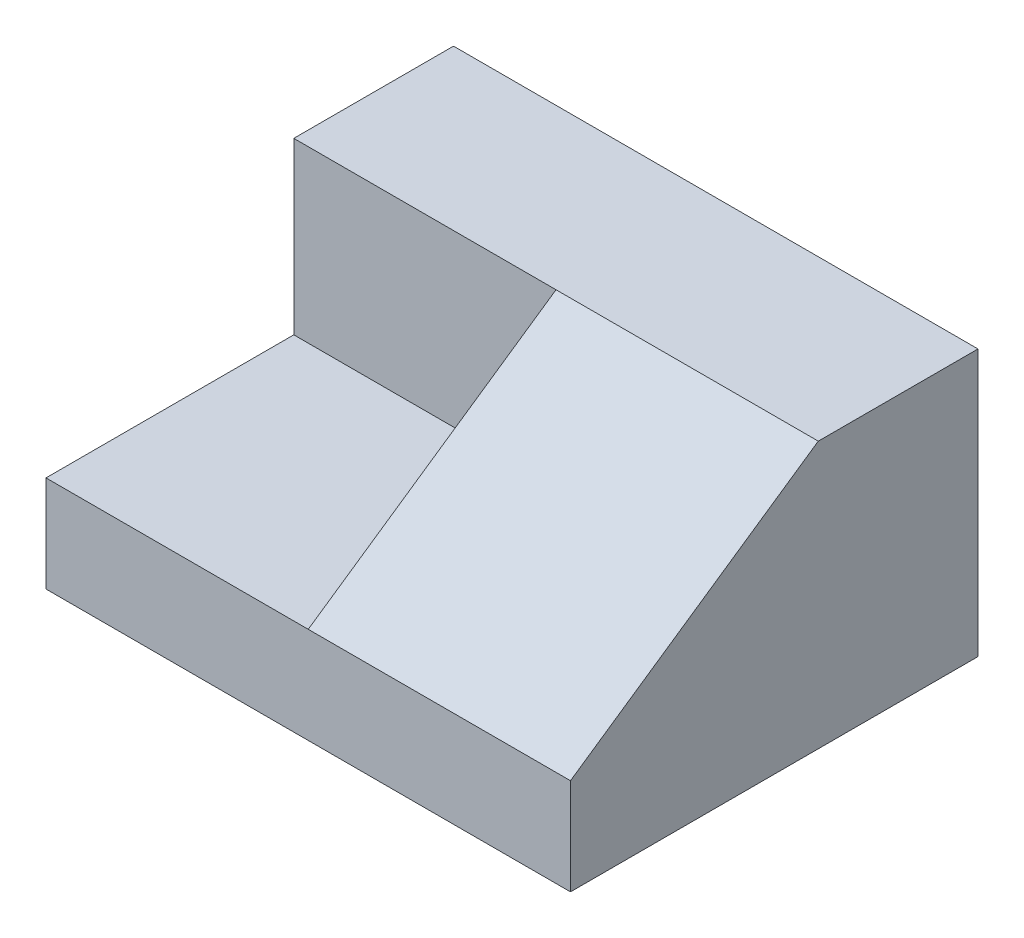
ISO-10303-21;
HEADER;
FILE_DESCRIPTION(('STEP AP214'),'2;1');
FILE_NAME('part.step','',(''),(''),'','','');
FILE_SCHEMA(('AUTOMOTIVE_DESIGN { 1 0 10303 214 1 1 1 1 }'));
ENDSEC;
DATA;
#1=APPLICATION_CONTEXT('core data for automotive mechanical design processes');
#2=APPLICATION_PROTOCOL_DEFINITION('international standard','automotive_design',2000,#1);
#3=PRODUCT_CONTEXT('',#1,'mechanical');
#4=PRODUCT('Part','Part','',(#3));
#5=PRODUCT_RELATED_PRODUCT_CATEGORY('part','',(#4));
#6=PRODUCT_DEFINITION_FORMATION('','',#4);
#7=PRODUCT_DEFINITION_CONTEXT('part definition',#1,'design');
#8=PRODUCT_DEFINITION('design','',#6,#7);
#9=PRODUCT_DEFINITION_SHAPE('','',#8);
#10=(LENGTH_UNIT() NAMED_UNIT(*) SI_UNIT(.MILLI.,.METRE.));
#11=(NAMED_UNIT(*) PLANE_ANGLE_UNIT() SI_UNIT($,.RADIAN.));
#12=(NAMED_UNIT(*) SI_UNIT($,.STERADIAN.) SOLID_ANGLE_UNIT());
#13=UNCERTAINTY_MEASURE_WITH_UNIT(LENGTH_MEASURE(1.E-05),#10,'distance_accuracy_value','');
#14=(GEOMETRIC_REPRESENTATION_CONTEXT(3) GLOBAL_UNCERTAINTY_ASSIGNED_CONTEXT((#13)) GLOBAL_UNIT_ASSIGNED_CONTEXT((#10,
#11,#12)) REPRESENTATION_CONTEXT('',''));
#15=CARTESIAN_POINT('',(0.,0.,0.));
#16=DIRECTION('',(0.,0.,1.));
#17=DIRECTION('',(1.,0.,0.));
#18=AXIS2_PLACEMENT_3D('',#15,#16,#17);
#19=CARTESIAN_POINT('',(100.,50.8011847790713,30.4522508199475));
#20=DIRECTION('',(0.,-0.824331600923871,-0.56610724400796));
#21=DIRECTION('',(0.,0.56610724400796,-0.824331600923871));
#22=AXIS2_PLACEMENT_3D('',#19,#20,#21);
#23=PLANE('',#22);
#24=DIRECTION('',(0.,0.56610724400796,-0.824331600923871));
#25=VECTOR('',#24,1.);
#26=CARTESIAN_POINT('',(50.,18.3567306344543,77.695929662109));
#27=LINE('',#26,#25);
#28=CARTESIAN_POINT('',(50.,18.3567306344543,77.695929662109));
#29=VERTEX_POINT('',#28);
#30=CARTESIAN_POINT('',(50.,50.8011847790713,30.4522508199475));
#31=VERTEX_POINT('',#30);
#32=EDGE_CURVE('E136',#29,#31,#27,.T.);
#33=ORIENTED_EDGE('',*,*,#32,.F.);
#34=DIRECTION('',(-1.,0.,0.));
#35=VECTOR('',#34,1.);
#36=CARTESIAN_POINT('',(100.,18.3567306344543,77.695929662109));
#37=LINE('',#36,#35);
#38=CARTESIAN_POINT('',(100.,18.3567306344543,77.695929662109));
#39=VERTEX_POINT('',#38);
#40=EDGE_CURVE('E106',#39,#29,#37,.T.);
#41=ORIENTED_EDGE('',*,*,#40,.F.);
#42=DIRECTION('',(0.,-0.56610724400796,0.824331600923871));
#43=VECTOR('',#42,1.);
#44=CARTESIAN_POINT('',(100.,50.8011847790713,30.4522508199475));
#45=LINE('',#44,#43);
#46=CARTESIAN_POINT('',(100.,50.8011847790713,30.4522508199475));
#47=VERTEX_POINT('',#46);
#48=EDGE_CURVE('E94',#47,#39,#45,.T.);
#49=ORIENTED_EDGE('',*,*,#48,.F.);
#50=DIRECTION('',(-1.,0.,0.));
#51=VECTOR('',#50,1.);
#52=CARTESIAN_POINT('',(100.,50.8011847790713,30.4522508199475));
#53=LINE('',#52,#51);
#54=EDGE_CURVE('E100',#47,#31,#53,.T.);
#55=ORIENTED_EDGE('',*,*,#54,.T.);
#56=EDGE_LOOP('',(#33,#41,#49,#55));
#57=FACE_BOUND('',#56,.T.);
#58=ADVANCED_FACE('F33',(#57),#23,.F.);
#59=CARTESIAN_POINT('',(100.,0.,77.695929662109));
#60=DIRECTION('',(0.,1.,0.));
#61=DIRECTION('',(0.,0.,1.));
#62=AXIS2_PLACEMENT_3D('',#59,#60,#61);
#63=PLANE('',#62);
#64=DIRECTION('',(0.,0.,-1.));
#65=VECTOR('',#64,1.);
#66=CARTESIAN_POINT('',(0.,0.,77.695929662109));
#67=LINE('',#66,#65);
#68=CARTESIAN_POINT('',(0.,0.,77.695929662109));
#69=VERTEX_POINT('',#68);
#70=CARTESIAN_POINT('',(0.,0.,0.));
#71=VERTEX_POINT('',#70);
#72=EDGE_CURVE('E114',#69,#71,#67,.T.);
#73=ORIENTED_EDGE('',*,*,#72,.T.);
#74=DIRECTION('',(-1.,0.,0.));
#75=VECTOR('',#74,1.);
#76=CARTESIAN_POINT('',(100.,0.,0.));
#77=LINE('',#76,#75);
#78=CARTESIAN_POINT('',(100.,0.,0.));
#79=VERTEX_POINT('',#78);
#80=EDGE_CURVE('E11',#79,#71,#77,.T.);
#81=ORIENTED_EDGE('',*,*,#80,.F.);
#82=DIRECTION('',(0.,0.,-1.));
#83=VECTOR('',#82,1.);
#84=CARTESIAN_POINT('',(100.,0.,77.695929662109));
#85=LINE('',#84,#83);
#86=CARTESIAN_POINT('',(100.,0.,77.695929662109));
#87=VERTEX_POINT('',#86);
#88=EDGE_CURVE('E123',#87,#79,#85,.T.);
#89=ORIENTED_EDGE('',*,*,#88,.F.);
#90=DIRECTION('',(-1.,0.,0.));
#91=VECTOR('',#90,1.);
#92=CARTESIAN_POINT('',(100.,0.,77.695929662109));
#93=LINE('',#92,#91);
#94=EDGE_CURVE('E110',#87,#69,#93,.T.);
#95=ORIENTED_EDGE('',*,*,#94,.T.);
#96=EDGE_LOOP('',(#73,#81,#89,#95));
#97=FACE_BOUND('',#96,.T.);
#98=ADVANCED_FACE('F35',(#97),#63,.F.);
#99=CARTESIAN_POINT('',(100.,0.,0.));
#100=DIRECTION('',(0.,0.,1.));
#101=DIRECTION('',(1.,0.,0.));
#102=AXIS2_PLACEMENT_3D('',#99,#100,#101);
#103=PLANE('',#102);
#104=DIRECTION('',(0.,1.,0.));
#105=VECTOR('',#104,1.);
#106=CARTESIAN_POINT('',(0.,0.,0.));
#107=LINE('',#106,#105);
#108=CARTESIAN_POINT('',(0.,50.8011847790713,0.));
#109=VERTEX_POINT('',#108);
#110=EDGE_CURVE('E117',#71,#109,#107,.T.);
#111=ORIENTED_EDGE('',*,*,#110,.T.);
#112=DIRECTION('',(-1.,0.,0.));
#113=VECTOR('',#112,1.);
#114=CARTESIAN_POINT('',(100.,50.8011847790713,0.));
#115=LINE('',#114,#113);
#116=CARTESIAN_POINT('',(100.,50.8011847790713,0.));
#117=VERTEX_POINT('',#116);
#118=EDGE_CURVE('E42',#117,#109,#115,.T.);
#119=ORIENTED_EDGE('',*,*,#118,.F.);
#120=DIRECTION('',(0.,1.,0.));
#121=VECTOR('',#120,1.);
#122=CARTESIAN_POINT('',(100.,0.,0.));
#123=LINE('',#122,#121);
#124=EDGE_CURVE('E83',#79,#117,#123,.T.);
#125=ORIENTED_EDGE('',*,*,#124,.F.);
#126=ORIENTED_EDGE('',*,*,#80,.T.);
#127=EDGE_LOOP('',(#111,#119,#125,#126));
#128=FACE_BOUND('',#127,.T.);
#129=ADVANCED_FACE('F150',(#128),#103,.F.);
#130=CARTESIAN_POINT('',(100.,50.8011847790713,0.));
#131=DIRECTION('',(0.,-1.,0.));
#132=DIRECTION('',(0.,0.,-1.));
#133=AXIS2_PLACEMENT_3D('',#130,#131,#132);
#134=PLANE('',#133);
#135=DIRECTION('',(0.,0.,1.));
#136=VECTOR('',#135,1.);
#137=CARTESIAN_POINT('',(0.,50.8011847790713,0.));
#138=LINE('',#137,#136);
#139=CARTESIAN_POINT('',(0.,50.8011847790713,30.4522508199475));
#140=VERTEX_POINT('',#139);
#141=EDGE_CURVE('E120',#109,#140,#138,.T.);
#142=ORIENTED_EDGE('',*,*,#141,.T.);
#143=DIRECTION('',(-1.,0.,0.));
#144=VECTOR('',#143,1.);
#145=CARTESIAN_POINT('',(50.,50.8011847790713,30.4522508199475));
#146=LINE('',#145,#144);
#147=EDGE_CURVE('E68',#31,#140,#146,.T.);
#148=ORIENTED_EDGE('',*,*,#147,.F.);
#149=ORIENTED_EDGE('',*,*,#54,.F.);
#150=DIRECTION('',(0.,0.,1.));
#151=VECTOR('',#150,1.);
#152=CARTESIAN_POINT('',(100.,50.8011847790713,0.));
#153=LINE('',#152,#151);
#154=EDGE_CURVE('E90',#117,#47,#153,.T.);
#155=ORIENTED_EDGE('',*,*,#154,.F.);
#156=ORIENTED_EDGE('',*,*,#118,.T.);
#157=EDGE_LOOP('',(#142,#148,#149,#155,#156));
#158=FACE_BOUND('',#157,.T.);
#159=ADVANCED_FACE('F102',(#158),#134,.F.);
#160=CARTESIAN_POINT('',(100.,18.3567306344543,77.695929662109));
#161=DIRECTION('',(0.,0.,-1.));
#162=DIRECTION('',(-1.,0.,0.));
#163=AXIS2_PLACEMENT_3D('',#160,#161,#162);
#164=PLANE('',#163);
#165=DIRECTION('',(0.,-1.,0.));
#166=VECTOR('',#165,1.);
#167=CARTESIAN_POINT('',(0.,18.3567306344543,77.695929662109));
#168=LINE('',#167,#166);
#169=CARTESIAN_POINT('',(0.,18.3567306344543,77.695929662109));
#170=VERTEX_POINT('',#169);
#171=EDGE_CURVE('E75',#170,#69,#168,.T.);
#172=ORIENTED_EDGE('',*,*,#171,.T.);
#173=ORIENTED_EDGE('',*,*,#94,.F.);
#174=DIRECTION('',(0.,-1.,0.));
#175=VECTOR('',#174,1.);
#176=CARTESIAN_POINT('',(100.,18.3567306344543,77.695929662109));
#177=LINE('',#176,#175);
#178=EDGE_CURVE('E50',#39,#87,#177,.T.);
#179=ORIENTED_EDGE('',*,*,#178,.F.);
#180=ORIENTED_EDGE('',*,*,#40,.T.);
#181=DIRECTION('',(-1.,0.,0.));
#182=VECTOR('',#181,1.);
#183=CARTESIAN_POINT('',(50.,18.3567306344543,77.695929662109));
#184=LINE('',#183,#182);
#185=EDGE_CURVE('E118',#29,#170,#184,.T.);
#186=ORIENTED_EDGE('',*,*,#185,.T.);
#187=EDGE_LOOP('',(#172,#173,#179,#180,#186));
#188=FACE_BOUND('',#187,.T.);
#189=ADVANCED_FACE('F156',(#188),#164,.F.);
#190=CARTESIAN_POINT('',(100.,0.,0.));
#191=DIRECTION('',(1.,0.,0.));
#192=DIRECTION('',(0.,0.,-1.));
#193=AXIS2_PLACEMENT_3D('',#190,#191,#192);
#194=PLANE('',#193);
#195=ORIENTED_EDGE('',*,*,#88,.T.);
#196=ORIENTED_EDGE('',*,*,#124,.T.);
#197=ORIENTED_EDGE('',*,*,#154,.T.);
#198=ORIENTED_EDGE('',*,*,#48,.T.);
#199=ORIENTED_EDGE('',*,*,#178,.T.);
#200=EDGE_LOOP('',(#195,#196,#197,#198,#199));
#201=FACE_BOUND('',#200,.T.);
#202=ADVANCED_FACE('F92',(#201),#194,.T.);
#203=CARTESIAN_POINT('',(0.,0.,0.));
#204=DIRECTION('',(1.,0.,0.));
#205=DIRECTION('',(0.,0.,-1.));
#206=AXIS2_PLACEMENT_3D('',#203,#204,#205);
#207=PLANE('',#206);
#208=ORIENTED_EDGE('',*,*,#171,.F.);
#209=DIRECTION('',(0.,0.,1.));
#210=VECTOR('',#209,1.);
#211=CARTESIAN_POINT('',(0.,18.3567306344543,30.4522508199475));
#212=LINE('',#211,#210);
#213=CARTESIAN_POINT('',(0.,18.3567306344543,30.4522508199475));
#214=VERTEX_POINT('',#213);
#215=EDGE_CURVE('E133',#214,#170,#212,.T.);
#216=ORIENTED_EDGE('',*,*,#215,.F.);
#217=DIRECTION('',(0.,-1.,0.));
#218=VECTOR('',#217,1.);
#219=CARTESIAN_POINT('',(0.,50.8011847790713,30.4522508199475));
#220=LINE('',#219,#218);
#221=EDGE_CURVE('E130',#140,#214,#220,.T.);
#222=ORIENTED_EDGE('',*,*,#221,.F.);
#223=ORIENTED_EDGE('',*,*,#141,.F.);
#224=ORIENTED_EDGE('',*,*,#110,.F.);
#225=ORIENTED_EDGE('',*,*,#72,.F.);
#226=EDGE_LOOP('',(#208,#216,#222,#223,#224,#225));
#227=FACE_BOUND('',#226,.T.);
#228=ADVANCED_FACE('F127',(#227),#207,.F.);
#229=CARTESIAN_POINT('',(50.,18.3567306344543,30.4522508199475));
#230=DIRECTION('',(0.,-1.,0.));
#231=DIRECTION('',(0.,0.,-1.));
#232=AXIS2_PLACEMENT_3D('',#229,#230,#231);
#233=PLANE('',#232);
#234=ORIENTED_EDGE('',*,*,#215,.T.);
#235=ORIENTED_EDGE('',*,*,#185,.F.);
#236=DIRECTION('',(0.,0.,1.));
#237=VECTOR('',#236,1.);
#238=CARTESIAN_POINT('',(50.,18.3567306344543,30.4522508199475));
#239=LINE('',#238,#237);
#240=CARTESIAN_POINT('',(50.,18.3567306344543,30.4522508199475));
#241=VERTEX_POINT('',#240);
#242=EDGE_CURVE('E139',#241,#29,#239,.T.);
#243=ORIENTED_EDGE('',*,*,#242,.F.);
#244=DIRECTION('',(-1.,0.,0.));
#245=VECTOR('',#244,1.);
#246=CARTESIAN_POINT('',(50.,18.3567306344543,30.4522508199475));
#247=LINE('',#246,#245);
#248=EDGE_CURVE('E143',#241,#214,#247,.T.);
#249=ORIENTED_EDGE('',*,*,#248,.T.);
#250=EDGE_LOOP('',(#234,#235,#243,#249));
#251=FACE_BOUND('',#250,.T.);
#252=ADVANCED_FACE('F167',(#251),#233,.F.);
#253=CARTESIAN_POINT('',(50.,50.8011847790713,30.4522508199475));
#254=DIRECTION('',(0.,0.,-1.));
#255=DIRECTION('',(-1.,0.,0.));
#256=AXIS2_PLACEMENT_3D('',#253,#254,#255);
#257=PLANE('',#256);
#258=ORIENTED_EDGE('',*,*,#221,.T.);
#259=ORIENTED_EDGE('',*,*,#248,.F.);
#260=DIRECTION('',(0.,-1.,0.));
#261=VECTOR('',#260,1.);
#262=CARTESIAN_POINT('',(50.,50.8011847790713,30.4522508199475));
#263=LINE('',#262,#261);
#264=EDGE_CURVE('E185',#31,#241,#263,.T.);
#265=ORIENTED_EDGE('',*,*,#264,.F.);
#266=ORIENTED_EDGE('',*,*,#147,.T.);
#267=EDGE_LOOP('',(#258,#259,#265,#266));
#268=FACE_BOUND('',#267,.T.);
#269=ADVANCED_FACE('F170',(#268),#257,.F.);
#270=CARTESIAN_POINT('',(50.,0.,0.));
#271=DIRECTION('',(-1.,0.,0.));
#272=DIRECTION('',(0.,0.,1.));
#273=AXIS2_PLACEMENT_3D('',#270,#271,#272);
#274=PLANE('',#273);
#275=ORIENTED_EDGE('',*,*,#32,.T.);
#276=ORIENTED_EDGE('',*,*,#264,.T.);
#277=ORIENTED_EDGE('',*,*,#242,.T.);
#278=EDGE_LOOP('',(#275,#276,#277));
#279=FACE_BOUND('',#278,.T.);
#280=ADVANCED_FACE('F173',(#279),#274,.T.);
#281=CLOSED_SHELL('',(#58,#98,#129,#159,#189,#202,#228,#252,#269,#280));
#282=MANIFOLD_SOLID_BREP('B2',#281);
#283=ADVANCED_BREP_SHAPE_REPRESENTATION('',(#18,#282),#14);
#284=SHAPE_DEFINITION_REPRESENTATION(#9,#283);
ENDSEC;
END-ISO-10303-21;
